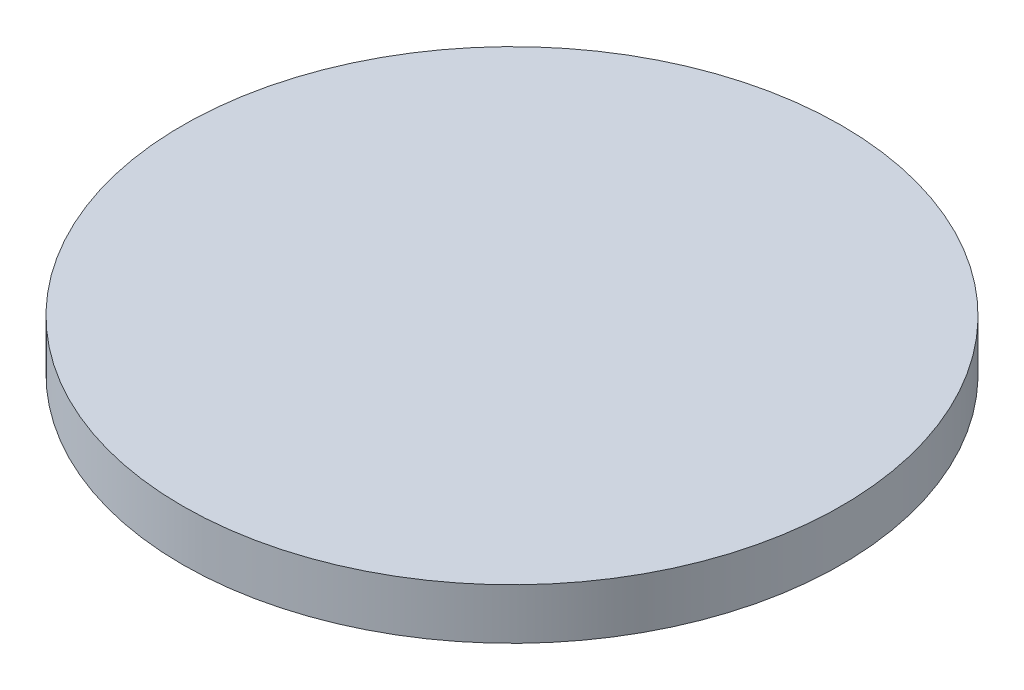
ISO-10303-21;
HEADER;
FILE_DESCRIPTION(('STEP AP214'),'2;1');
FILE_NAME('part.step','',(''),(''),'','','');
FILE_SCHEMA(('AUTOMOTIVE_DESIGN { 1 0 10303 214 1 1 1 1 }'));
ENDSEC;
DATA;
#1=APPLICATION_CONTEXT('core data for automotive mechanical design processes');
#2=APPLICATION_PROTOCOL_DEFINITION('international standard','automotive_design',2000,#1);
#3=PRODUCT_CONTEXT('',#1,'mechanical');
#4=PRODUCT('Part','Part','',(#3));
#5=PRODUCT_RELATED_PRODUCT_CATEGORY('part','',(#4));
#6=PRODUCT_DEFINITION_FORMATION('','',#4);
#7=PRODUCT_DEFINITION_CONTEXT('part definition',#1,'design');
#8=PRODUCT_DEFINITION('design','',#6,#7);
#9=PRODUCT_DEFINITION_SHAPE('','',#8);
#10=(LENGTH_UNIT() NAMED_UNIT(*) SI_UNIT(.MILLI.,.METRE.));
#11=(NAMED_UNIT(*) PLANE_ANGLE_UNIT() SI_UNIT($,.RADIAN.));
#12=(NAMED_UNIT(*) SI_UNIT($,.STERADIAN.) SOLID_ANGLE_UNIT());
#13=UNCERTAINTY_MEASURE_WITH_UNIT(LENGTH_MEASURE(1.E-05),#10,'distance_accuracy_value','');
#14=(GEOMETRIC_REPRESENTATION_CONTEXT(3) GLOBAL_UNCERTAINTY_ASSIGNED_CONTEXT((#13)) GLOBAL_UNIT_ASSIGNED_CONTEXT((#10,
#11,#12)) REPRESENTATION_CONTEXT('',''));
#15=CARTESIAN_POINT('',(0.,0.,0.));
#16=DIRECTION('',(0.,0.,1.));
#17=DIRECTION('',(1.,0.,0.));
#18=AXIS2_PLACEMENT_3D('',#15,#16,#17);
#19=CARTESIAN_POINT('',(0.,12.7,0.));
#20=DIRECTION('',(0.,-1.,0.));
#21=DIRECTION('',(0.,0.,-1.));
#22=AXIS2_PLACEMENT_3D('',#19,#20,#21);
#23=CYLINDRICAL_SURFACE('',#22,82.5);
#24=CARTESIAN_POINT('',(0.,12.7,0.));
#25=DIRECTION('',(0.,1.,0.));
#26=DIRECTION('',(0.,0.,1.));
#27=AXIS2_PLACEMENT_3D('',#24,#25,#26);
#28=CIRCLE('',#27,82.5);
#29=CARTESIAN_POINT('',(0.,12.7,82.5));
#30=VERTEX_POINT('',#29);
#31=EDGE_CURVE('E10',#30,#30,#28,.T.);
#32=ORIENTED_EDGE('',*,*,#31,.F.);
#33=EDGE_LOOP('',(#32));
#34=FACE_BOUND('',#33,.T.);
#35=CARTESIAN_POINT('',(0.,0.,0.));
#36=DIRECTION('',(0.,1.,0.));
#37=DIRECTION('',(0.,0.,1.));
#38=AXIS2_PLACEMENT_3D('',#35,#36,#37);
#39=CIRCLE('',#38,82.5);
#40=CARTESIAN_POINT('',(0.,0.,82.5));
#41=VERTEX_POINT('',#40);
#42=EDGE_CURVE('E35',#41,#41,#39,.T.);
#43=ORIENTED_EDGE('',*,*,#42,.T.);
#44=EDGE_LOOP('',(#43));
#45=FACE_BOUND('',#44,.T.);
#46=ADVANCED_FACE('F32',(#34,#45),#23,.T.);
#47=CARTESIAN_POINT('',(0.,12.7,0.));
#48=DIRECTION('',(0.,1.,0.));
#49=DIRECTION('',(0.,0.,1.));
#50=AXIS2_PLACEMENT_3D('',#47,#48,#49);
#51=PLANE('',#50);
#52=ORIENTED_EDGE('',*,*,#31,.T.);
#53=EDGE_LOOP('',(#52));
#54=FACE_BOUND('',#53,.T.);
#55=ADVANCED_FACE('F47',(#54),#51,.T.);
#56=CARTESIAN_POINT('',(0.,0.,0.));
#57=DIRECTION('',(0.,1.,0.));
#58=DIRECTION('',(0.,0.,1.));
#59=AXIS2_PLACEMENT_3D('',#56,#57,#58);
#60=PLANE('',#59);
#61=ORIENTED_EDGE('',*,*,#42,.F.);
#62=EDGE_LOOP('',(#61));
#63=FACE_BOUND('',#62,.T.);
#64=ADVANCED_FACE('F45',(#63),#60,.F.);
#65=CLOSED_SHELL('',(#46,#55,#64));
#66=MANIFOLD_SOLID_BREP('B2',#65);
#67=ADVANCED_BREP_SHAPE_REPRESENTATION('',(#18,#66),#14);
#68=SHAPE_DEFINITION_REPRESENTATION(#9,#67);
ENDSEC;
END-ISO-10303-21;
